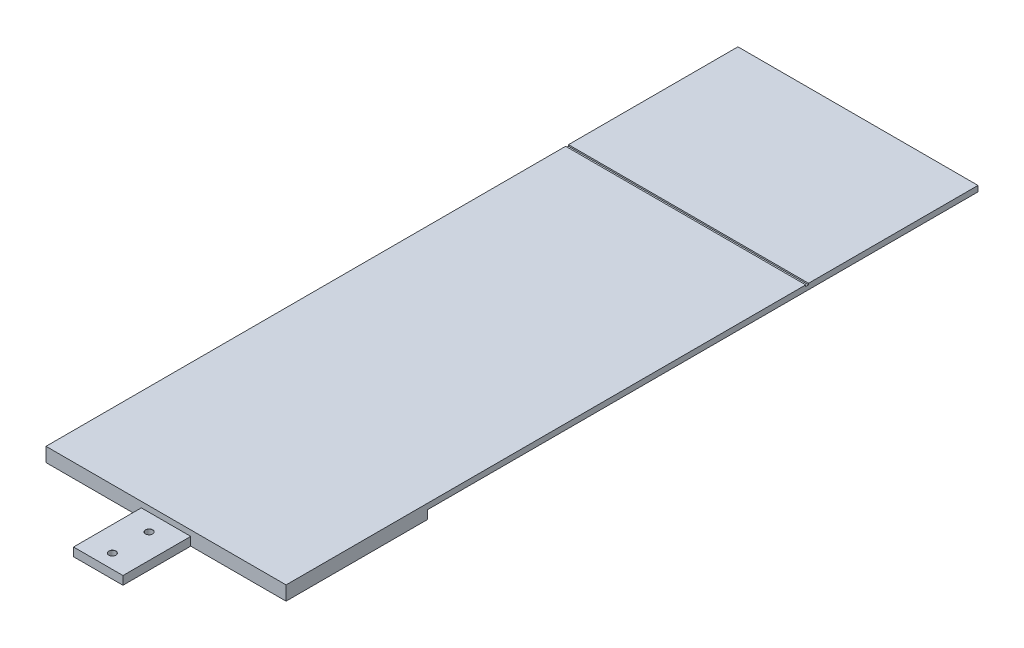
ISO-10303-21;
HEADER;
FILE_DESCRIPTION(('STEP AP214'),'2;1');
FILE_NAME('part.step','',(''),(''),'','','');
FILE_SCHEMA(('AUTOMOTIVE_DESIGN { 1 0 10303 214 1 1 1 1 }'));
ENDSEC;
DATA;
#1=APPLICATION_CONTEXT('core data for automotive mechanical design processes');
#2=APPLICATION_PROTOCOL_DEFINITION('international standard','automotive_design',2000,#1);
#3=PRODUCT_CONTEXT('',#1,'mechanical');
#4=PRODUCT('Part','Part','',(#3));
#5=PRODUCT_RELATED_PRODUCT_CATEGORY('part','',(#4));
#6=PRODUCT_DEFINITION_FORMATION('','',#4);
#7=PRODUCT_DEFINITION_CONTEXT('part definition',#1,'design');
#8=PRODUCT_DEFINITION('design','',#6,#7);
#9=PRODUCT_DEFINITION_SHAPE('','',#8);
#10=(LENGTH_UNIT() NAMED_UNIT(*) SI_UNIT(.MILLI.,.METRE.));
#11=(NAMED_UNIT(*) PLANE_ANGLE_UNIT() SI_UNIT($,.RADIAN.));
#12=(NAMED_UNIT(*) SI_UNIT($,.STERADIAN.) SOLID_ANGLE_UNIT());
#13=UNCERTAINTY_MEASURE_WITH_UNIT(LENGTH_MEASURE(1.E-05),#10,'distance_accuracy_value','');
#14=(GEOMETRIC_REPRESENTATION_CONTEXT(3) GLOBAL_UNCERTAINTY_ASSIGNED_CONTEXT((#13)) GLOBAL_UNIT_ASSIGNED_CONTEXT((#10,
#11,#12)) REPRESENTATION_CONTEXT('',''));
#15=CARTESIAN_POINT('',(0.,0.,0.));
#16=DIRECTION('',(0.,0.,1.));
#17=DIRECTION('',(1.,0.,0.));
#18=AXIS2_PLACEMENT_3D('',#15,#16,#17);
#19=CARTESIAN_POINT('',(0.,5.,0.));
#20=DIRECTION('',(0.,1.,0.));
#21=DIRECTION('',(0.,0.,1.));
#22=AXIS2_PLACEMENT_3D('',#19,#20,#21);
#23=PLANE('',#22);
#24=DIRECTION('',(-1.,0.,0.));
#25=VECTOR('',#24,1.);
#26=CARTESIAN_POINT('',(42.5000000000001,5.,-185.));
#27=LINE('',#26,#25);
#28=CARTESIAN_POINT('',(42.5000000000001,5.,-185.));
#29=VERTEX_POINT('',#28);
#30=CARTESIAN_POINT('',(-42.5,5.,-185.));
#31=VERTEX_POINT('',#30);
#32=EDGE_CURVE('E190',#29,#31,#27,.T.);
#33=ORIENTED_EDGE('',*,*,#32,.F.);
#34=DIRECTION('',(0.,0.,-1.));
#35=VECTOR('',#34,1.);
#36=CARTESIAN_POINT('',(42.5,5.,0.));
#37=LINE('',#36,#35);
#38=CARTESIAN_POINT('',(42.5,5.,-245.));
#39=VERTEX_POINT('',#38);
#40=EDGE_CURVE('E186',#29,#39,#37,.T.);
#41=ORIENTED_EDGE('',*,*,#40,.T.);
#42=DIRECTION('',(-1.,0.,0.));
#43=VECTOR('',#42,1.);
#44=CARTESIAN_POINT('',(42.5,5.,-245.));
#45=LINE('',#44,#43);
#46=CARTESIAN_POINT('',(-42.5,5.,-245.));
#47=VERTEX_POINT('',#46);
#48=EDGE_CURVE('E201',#39,#47,#45,.T.);
#49=ORIENTED_EDGE('',*,*,#48,.T.);
#50=DIRECTION('',(0.,0.,1.));
#51=VECTOR('',#50,1.);
#52=CARTESIAN_POINT('',(-42.5,5.,0.));
#53=LINE('',#52,#51);
#54=EDGE_CURVE('E204',#47,#31,#53,.T.);
#55=ORIENTED_EDGE('',*,*,#54,.T.);
#56=EDGE_LOOP('',(#33,#41,#49,#55));
#57=FACE_BOUND('',#56,.T.);
#58=ADVANCED_FACE('F38',(#57),#23,.T.);
#59=CARTESIAN_POINT('',(-42.5,3.,0.));
#60=DIRECTION('',(0.,0.,-1.));
#61=DIRECTION('',(-1.,0.,0.));
#62=AXIS2_PLACEMENT_3D('',#59,#60,#61);
#63=PLANE('',#62);
#64=DIRECTION('',(1.,0.,0.));
#65=VECTOR('',#64,1.);
#66=CARTESIAN_POINT('',(-42.5,0.,0.));
#67=LINE('',#66,#65);
#68=CARTESIAN_POINT('',(-42.5,0.,0.));
#69=VERTEX_POINT('',#68);
#70=CARTESIAN_POINT('',(-8.75,0.,0.));
#71=VERTEX_POINT('',#70);
#72=EDGE_CURVE('E296',#69,#71,#67,.T.);
#73=ORIENTED_EDGE('',*,*,#72,.T.);
#74=DIRECTION('',(0.,1.,0.));
#75=VECTOR('',#74,1.);
#76=CARTESIAN_POINT('',(-8.75,-29.7026934805583,0.));
#77=LINE('',#76,#75);
#78=CARTESIAN_POINT('',(-8.75,3.,0.));
#79=VERTEX_POINT('',#78);
#80=EDGE_CURVE('E274',#71,#79,#77,.T.);
#81=ORIENTED_EDGE('',*,*,#80,.T.);
#82=DIRECTION('',(1.,0.,0.));
#83=VECTOR('',#82,1.);
#84=CARTESIAN_POINT('',(42.5,3.,0.));
#85=LINE('',#84,#83);
#86=CARTESIAN_POINT('',(8.75,3.,0.));
#87=VERTEX_POINT('',#86);
#88=EDGE_CURVE('E46',#79,#87,#85,.T.);
#89=ORIENTED_EDGE('',*,*,#88,.T.);
#90=DIRECTION('',(0.,1.,0.));
#91=VECTOR('',#90,1.);
#92=CARTESIAN_POINT('',(8.75,-29.7026934805583,0.));
#93=LINE('',#92,#91);
#94=CARTESIAN_POINT('',(8.75,0.,0.));
#95=VERTEX_POINT('',#94);
#96=EDGE_CURVE('E262',#95,#87,#93,.T.);
#97=ORIENTED_EDGE('',*,*,#96,.F.);
#98=CARTESIAN_POINT('',(42.5,0.,0.));
#99=VERTEX_POINT('',#98);
#100=EDGE_CURVE('E284',#95,#99,#67,.T.);
#101=ORIENTED_EDGE('',*,*,#100,.T.);
#102=DIRECTION('',(0.,-1.,0.));
#103=VECTOR('',#102,1.);
#104=CARTESIAN_POINT('',(42.5,3.,0.));
#105=LINE('',#104,#103);
#106=CARTESIAN_POINT('',(42.5,5.,0.));
#107=VERTEX_POINT('',#106);
#108=EDGE_CURVE('E219',#107,#99,#105,.T.);
#109=ORIENTED_EDGE('',*,*,#108,.F.);
#110=DIRECTION('',(1.,0.,0.));
#111=VECTOR('',#110,1.);
#112=CARTESIAN_POINT('',(42.5,5.,0.));
#113=LINE('',#112,#111);
#114=CARTESIAN_POINT('',(-42.5,5.,0.));
#115=VERTEX_POINT('',#114);
#116=EDGE_CURVE('E207',#115,#107,#113,.T.);
#117=ORIENTED_EDGE('',*,*,#116,.F.);
#118=DIRECTION('',(0.,-1.,0.));
#119=VECTOR('',#118,1.);
#120=CARTESIAN_POINT('',(-42.5,3.,0.));
#121=LINE('',#120,#119);
#122=EDGE_CURVE('E295',#115,#69,#121,.T.);
#123=ORIENTED_EDGE('',*,*,#122,.T.);
#124=EDGE_LOOP('',(#73,#81,#89,#97,#101,#109,#117,#123));
#125=FACE_BOUND('',#124,.T.);
#126=ADVANCED_FACE('F40',(#125),#63,.F.);
#127=CARTESIAN_POINT('',(42.5,3.,0.));
#128=DIRECTION('',(-1.,0.,0.));
#129=DIRECTION('',(0.,0.,1.));
#130=AXIS2_PLACEMENT_3D('',#127,#128,#129);
#131=PLANE('',#130);
#132=ORIENTED_EDGE('',*,*,#40,.F.);
#133=DIRECTION('',(0.,-1.,0.));
#134=VECTOR('',#133,1.);
#135=CARTESIAN_POINT('',(42.5000000000001,5.,-185.));
#136=LINE('',#135,#134);
#137=CARTESIAN_POINT('',(42.5000000000001,4.5,-185.));
#138=VERTEX_POINT('',#137);
#139=EDGE_CURVE('E168',#29,#138,#136,.T.);
#140=ORIENTED_EDGE('',*,*,#139,.T.);
#141=DIRECTION('',(0.,0.,1.));
#142=VECTOR('',#141,1.);
#143=CARTESIAN_POINT('',(42.5000000000001,4.5,-185.));
#144=LINE('',#143,#142);
#145=CARTESIAN_POINT('',(42.5000000000001,4.5,-184.));
#146=VERTEX_POINT('',#145);
#147=EDGE_CURVE('E177',#138,#146,#144,.T.);
#148=ORIENTED_EDGE('',*,*,#147,.T.);
#149=DIRECTION('',(0.,1.,0.));
#150=VECTOR('',#149,1.);
#151=CARTESIAN_POINT('',(42.5000000000001,5.,-184.));
#152=LINE('',#151,#150);
#153=CARTESIAN_POINT('',(42.5000000000001,5.,-184.));
#154=VERTEX_POINT('',#153);
#155=EDGE_CURVE('E174',#146,#154,#152,.T.);
#156=ORIENTED_EDGE('',*,*,#155,.T.);
#157=EDGE_CURVE('E198',#107,#154,#37,.T.);
#158=ORIENTED_EDGE('',*,*,#157,.F.);
#159=ORIENTED_EDGE('',*,*,#108,.T.);
#160=DIRECTION('',(0.,0.,-1.));
#161=VECTOR('',#160,1.);
#162=CARTESIAN_POINT('',(42.5,0.,0.));
#163=LINE('',#162,#161);
#164=CARTESIAN_POINT('',(42.5,0.,-50.));
#165=VERTEX_POINT('',#164);
#166=EDGE_CURVE('E298',#99,#165,#163,.T.);
#167=ORIENTED_EDGE('',*,*,#166,.T.);
#168=DIRECTION('',(0.,-1.,0.));
#169=VECTOR('',#168,1.);
#170=CARTESIAN_POINT('',(42.5,3.,-50.));
#171=LINE('',#170,#169);
#172=CARTESIAN_POINT('',(42.5,3.,-50.));
#173=VERTEX_POINT('',#172);
#174=EDGE_CURVE('E313',#173,#165,#171,.T.);
#175=ORIENTED_EDGE('',*,*,#174,.F.);
#176=DIRECTION('',(0.,0.,-1.));
#177=VECTOR('',#176,1.);
#178=CARTESIAN_POINT('',(42.5,3.,0.));
#179=LINE('',#178,#177);
#180=CARTESIAN_POINT('',(42.5,3.,-245.));
#181=VERTEX_POINT('',#180);
#182=EDGE_CURVE('E197',#173,#181,#179,.T.);
#183=ORIENTED_EDGE('',*,*,#182,.T.);
#184=DIRECTION('',(0.,-1.,0.));
#185=VECTOR('',#184,1.);
#186=CARTESIAN_POINT('',(42.5,5.,-245.));
#187=LINE('',#186,#185);
#188=EDGE_CURVE('E222',#39,#181,#187,.T.);
#189=ORIENTED_EDGE('',*,*,#188,.F.);
#190=EDGE_LOOP('',(#132,#140,#148,#156,#158,#159,#167,#175,#183,#189));
#191=FACE_BOUND('',#190,.T.);
#192=ADVANCED_FACE('F184',(#191),#131,.F.);
#193=CARTESIAN_POINT('',(42.5,3.,-50.));
#194=DIRECTION('',(0.,0.,1.));
#195=DIRECTION('',(1.,0.,0.));
#196=AXIS2_PLACEMENT_3D('',#193,#194,#195);
#197=PLANE('',#196);
#198=DIRECTION('',(-1.,0.,0.));
#199=VECTOR('',#198,1.);
#200=CARTESIAN_POINT('',(42.5,0.,-50.));
#201=LINE('',#200,#199);
#202=CARTESIAN_POINT('',(32.,0.,-50.));
#203=VERTEX_POINT('',#202);
#204=EDGE_CURVE('E300',#165,#203,#201,.T.);
#205=ORIENTED_EDGE('',*,*,#204,.T.);
#206=DIRECTION('',(0.,-1.,0.));
#207=VECTOR('',#206,1.);
#208=CARTESIAN_POINT('',(32.,3.,-50.));
#209=LINE('',#208,#207);
#210=CARTESIAN_POINT('',(32.,3.,-50.));
#211=VERTEX_POINT('',#210);
#212=EDGE_CURVE('E61',#211,#203,#209,.T.);
#213=ORIENTED_EDGE('',*,*,#212,.F.);
#214=DIRECTION('',(-1.,0.,0.));
#215=VECTOR('',#214,1.);
#216=CARTESIAN_POINT('',(42.5,3.,-50.));
#217=LINE('',#216,#215);
#218=EDGE_CURVE('E285',#173,#211,#217,.T.);
#219=ORIENTED_EDGE('',*,*,#218,.F.);
#220=ORIENTED_EDGE('',*,*,#174,.T.);
#221=EDGE_LOOP('',(#205,#213,#219,#220));
#222=FACE_BOUND('',#221,.T.);
#223=ADVANCED_FACE('F410',(#222),#197,.F.);
#224=CARTESIAN_POINT('',(8.75,3.,-26.1843013959278));
#225=DIRECTION('',(0.,0.,1.));
#226=DIRECTION('',(1.,0.,0.));
#227=AXIS2_PLACEMENT_3D('',#224,#225,#226);
#228=PLANE('',#227);
#229=DIRECTION('',(-1.,0.,0.));
#230=VECTOR('',#229,1.);
#231=CARTESIAN_POINT('',(8.75,0.,-26.1843013959278));
#232=LINE('',#231,#230);
#233=CARTESIAN_POINT('',(25.,0.,-26.1843013959278));
#234=VERTEX_POINT('',#233);
#235=CARTESIAN_POINT('',(-25.,0.,-26.1843013959278));
#236=VERTEX_POINT('',#235);
#237=EDGE_CURVE('E303',#234,#236,#232,.T.);
#238=ORIENTED_EDGE('',*,*,#237,.T.);
#239=DIRECTION('',(0.,-1.,0.));
#240=VECTOR('',#239,1.);
#241=CARTESIAN_POINT('',(-25.,3.,-26.1843013959278));
#242=LINE('',#241,#240);
#243=CARTESIAN_POINT('',(-25.,3.,-26.1843013959278));
#244=VERTEX_POINT('',#243);
#245=EDGE_CURVE('E239',#244,#236,#242,.T.);
#246=ORIENTED_EDGE('',*,*,#245,.F.);
#247=DIRECTION('',(-1.,0.,0.));
#248=VECTOR('',#247,1.);
#249=CARTESIAN_POINT('',(8.75,3.,-26.1843013959278));
#250=LINE('',#249,#248);
#251=CARTESIAN_POINT('',(25.,3.,-26.1843013959278));
#252=VERTEX_POINT('',#251);
#253=EDGE_CURVE('E288',#252,#244,#250,.T.);
#254=ORIENTED_EDGE('',*,*,#253,.F.);
#255=DIRECTION('',(0.,-1.,0.));
#256=VECTOR('',#255,1.);
#257=CARTESIAN_POINT('',(25.,3.,-26.1843013959278));
#258=LINE('',#257,#256);
#259=EDGE_CURVE('E242',#252,#234,#258,.T.);
#260=ORIENTED_EDGE('',*,*,#259,.T.);
#261=EDGE_LOOP('',(#238,#246,#254,#260));
#262=FACE_BOUND('',#261,.T.);
#263=ADVANCED_FACE('F492',(#262),#228,.F.);
#264=CARTESIAN_POINT('',(-22.5,3.,-50.));
#265=DIRECTION('',(0.,0.,1.));
#266=DIRECTION('',(1.,0.,0.));
#267=AXIS2_PLACEMENT_3D('',#264,#265,#266);
#268=PLANE('',#267);
#269=DIRECTION('',(-1.,0.,0.));
#270=VECTOR('',#269,1.);
#271=CARTESIAN_POINT('',(-22.5,3.,-50.));
#272=LINE('',#271,#270);
#273=CARTESIAN_POINT('',(-32.,3.,-50.));
#274=VERTEX_POINT('',#273);
#275=CARTESIAN_POINT('',(-42.5,3.,-50.));
#276=VERTEX_POINT('',#275);
#277=EDGE_CURVE('E292',#274,#276,#272,.T.);
#278=ORIENTED_EDGE('',*,*,#277,.F.);
#279=DIRECTION('',(0.,-1.,0.));
#280=VECTOR('',#279,1.);
#281=CARTESIAN_POINT('',(-32.,3.,-50.));
#282=LINE('',#281,#280);
#283=CARTESIAN_POINT('',(-32.,0.,-50.));
#284=VERTEX_POINT('',#283);
#285=EDGE_CURVE('E235',#274,#284,#282,.T.);
#286=ORIENTED_EDGE('',*,*,#285,.T.);
#287=DIRECTION('',(-1.,0.,0.));
#288=VECTOR('',#287,1.);
#289=CARTESIAN_POINT('',(-22.5,0.,-50.));
#290=LINE('',#289,#288);
#291=CARTESIAN_POINT('',(-42.5,0.,-50.));
#292=VERTEX_POINT('',#291);
#293=EDGE_CURVE('E305',#284,#292,#290,.T.);
#294=ORIENTED_EDGE('',*,*,#293,.T.);
#295=DIRECTION('',(0.,-1.,0.));
#296=VECTOR('',#295,1.);
#297=CARTESIAN_POINT('',(-42.5,3.,-50.));
#298=LINE('',#297,#296);
#299=EDGE_CURVE('E310',#276,#292,#298,.T.);
#300=ORIENTED_EDGE('',*,*,#299,.F.);
#301=EDGE_LOOP('',(#278,#286,#294,#300));
#302=FACE_BOUND('',#301,.T.);
#303=ADVANCED_FACE('F398',(#302),#268,.F.);
#304=CARTESIAN_POINT('',(-42.5,3.,-50.));
#305=DIRECTION('',(1.,0.,0.));
#306=DIRECTION('',(0.,0.,-1.));
#307=AXIS2_PLACEMENT_3D('',#304,#305,#306);
#308=PLANE('',#307);
#309=DIRECTION('',(0.,0.,-1.));
#310=VECTOR('',#309,1.);
#311=CARTESIAN_POINT('',(-42.5,4.5,-50.));
#312=LINE('',#311,#310);
#313=CARTESIAN_POINT('',(-42.5,4.5,-184.));
#314=VERTEX_POINT('',#313);
#315=CARTESIAN_POINT('',(-42.5,4.5,-185.));
#316=VERTEX_POINT('',#315);
#317=EDGE_CURVE('E11',#314,#316,#312,.T.);
#318=ORIENTED_EDGE('',*,*,#317,.T.);
#319=DIRECTION('',(0.,1.,0.));
#320=VECTOR('',#319,1.);
#321=CARTESIAN_POINT('',(-42.5,3.,-185.));
#322=LINE('',#321,#320);
#323=EDGE_CURVE('E171',#316,#31,#322,.T.);
#324=ORIENTED_EDGE('',*,*,#323,.T.);
#325=ORIENTED_EDGE('',*,*,#54,.F.);
#326=DIRECTION('',(0.,-1.,0.));
#327=VECTOR('',#326,1.);
#328=CARTESIAN_POINT('',(-42.5,5.,-245.));
#329=LINE('',#328,#327);
#330=CARTESIAN_POINT('',(-42.5,3.,-245.));
#331=VERTEX_POINT('',#330);
#332=EDGE_CURVE('E210',#47,#331,#329,.T.);
#333=ORIENTED_EDGE('',*,*,#332,.T.);
#334=DIRECTION('',(0.,0.,1.));
#335=VECTOR('',#334,1.);
#336=CARTESIAN_POINT('',(-42.5,3.,0.));
#337=LINE('',#336,#335);
#338=EDGE_CURVE('E214',#331,#276,#337,.T.);
#339=ORIENTED_EDGE('',*,*,#338,.T.);
#340=ORIENTED_EDGE('',*,*,#299,.T.);
#341=DIRECTION('',(0.,0.,1.));
#342=VECTOR('',#341,1.);
#343=CARTESIAN_POINT('',(-42.5,0.,-50.));
#344=LINE('',#343,#342);
#345=EDGE_CURVE('E289',#292,#69,#344,.T.);
#346=ORIENTED_EDGE('',*,*,#345,.T.);
#347=ORIENTED_EDGE('',*,*,#122,.F.);
#348=CARTESIAN_POINT('',(-42.5,5.,-184.));
#349=VERTEX_POINT('',#348);
#350=EDGE_CURVE('E203',#349,#115,#53,.T.);
#351=ORIENTED_EDGE('',*,*,#350,.F.);
#352=DIRECTION('',(0.,-1.,0.));
#353=VECTOR('',#352,1.);
#354=CARTESIAN_POINT('',(-42.5,3.,-184.));
#355=LINE('',#354,#353);
#356=EDGE_CURVE('E53',#349,#314,#355,.T.);
#357=ORIENTED_EDGE('',*,*,#356,.T.);
#358=EDGE_LOOP('',(#318,#324,#325,#333,#339,#340,#346,#347,#351,#357));
#359=FACE_BOUND('',#358,.T.);
#360=ADVANCED_FACE('F366',(#359),#308,.F.);
#361=CARTESIAN_POINT('',(0.,3.,0.));
#362=DIRECTION('',(0.,1.,0.));
#363=DIRECTION('',(0.,0.,1.));
#364=AXIS2_PLACEMENT_3D('',#361,#362,#363);
#365=PLANE('',#364);
#366=ORIENTED_EDGE('',*,*,#88,.F.);
#367=DIRECTION('',(0.,0.,1.));
#368=VECTOR('',#367,1.);
#369=CARTESIAN_POINT('',(-8.75,3.,0.));
#370=LINE('',#369,#368);
#371=CARTESIAN_POINT('',(-8.75,3.,24.));
#372=VERTEX_POINT('',#371);
#373=EDGE_CURVE('E265',#79,#372,#370,.T.);
#374=ORIENTED_EDGE('',*,*,#373,.T.);
#375=DIRECTION('',(1.,0.,0.));
#376=VECTOR('',#375,1.);
#377=CARTESIAN_POINT('',(-8.75,3.,24.));
#378=LINE('',#377,#376);
#379=CARTESIAN_POINT('',(8.75,3.,24.));
#380=VERTEX_POINT('',#379);
#381=EDGE_CURVE('E268',#372,#380,#378,.T.);
#382=ORIENTED_EDGE('',*,*,#381,.T.);
#383=DIRECTION('',(0.,0.,-1.));
#384=VECTOR('',#383,1.);
#385=CARTESIAN_POINT('',(8.75,3.,24.));
#386=LINE('',#385,#384);
#387=EDGE_CURVE('E271',#380,#87,#386,.T.);
#388=ORIENTED_EDGE('',*,*,#387,.T.);
#389=EDGE_LOOP('',(#366,#374,#382,#388));
#390=FACE_BOUND('',#389,.T.);
#391=CARTESIAN_POINT('',(0.,3.,19.));
#392=DIRECTION('',(0.,1.,0.));
#393=DIRECTION('',(0.,0.,1.));
#394=AXIS2_PLACEMENT_3D('',#391,#392,#393);
#395=CIRCLE('',#394,1.275);
#396=CARTESIAN_POINT('',(0.,3.,20.275));
#397=VERTEX_POINT('',#396);
#398=EDGE_CURVE('E238',#397,#397,#395,.T.);
#399=ORIENTED_EDGE('',*,*,#398,.F.);
#400=EDGE_LOOP('',(#399));
#401=FACE_BOUND('',#400,.T.);
#402=CARTESIAN_POINT('',(0.,3.,6.));
#403=DIRECTION('',(0.,1.,0.));
#404=DIRECTION('',(0.,0.,1.));
#405=AXIS2_PLACEMENT_3D('',#402,#403,#404);
#406=CIRCLE('',#405,1.275);
#407=CARTESIAN_POINT('',(0.,3.,7.275));
#408=VERTEX_POINT('',#407);
#409=EDGE_CURVE('E252',#408,#408,#406,.T.);
#410=ORIENTED_EDGE('',*,*,#409,.F.);
#411=EDGE_LOOP('',(#410));
#412=FACE_BOUND('',#411,.T.);
#413=ADVANCED_FACE('F397',(#390,#401,#412),#365,.T.);
#414=CARTESIAN_POINT('',(0.,0.,0.));
#415=DIRECTION('',(0.,1.,0.));
#416=DIRECTION('',(0.,0.,1.));
#417=AXIS2_PLACEMENT_3D('',#414,#415,#416);
#418=PLANE('',#417);
#419=CARTESIAN_POINT('',(0.,0.,19.));
#420=DIRECTION('',(0.,1.,0.));
#421=DIRECTION('',(0.,0.,1.));
#422=AXIS2_PLACEMENT_3D('',#419,#420,#421);
#423=CIRCLE('',#422,1.25);
#424=CARTESIAN_POINT('',(0.,0.,20.25));
#425=VERTEX_POINT('',#424);
#426=EDGE_CURVE('E251',#425,#425,#423,.T.);
#427=ORIENTED_EDGE('',*,*,#426,.T.);
#428=EDGE_LOOP('',(#427));
#429=FACE_BOUND('',#428,.T.);
#430=CARTESIAN_POINT('',(0.,0.,6.));
#431=DIRECTION('',(0.,1.,0.));
#432=DIRECTION('',(0.,0.,1.));
#433=AXIS2_PLACEMENT_3D('',#430,#431,#432);
#434=CIRCLE('',#433,1.25);
#435=CARTESIAN_POINT('',(0.,0.,7.25));
#436=VERTEX_POINT('',#435);
#437=EDGE_CURVE('E258',#436,#436,#434,.T.);
#438=ORIENTED_EDGE('',*,*,#437,.T.);
#439=EDGE_LOOP('',(#438));
#440=FACE_BOUND('',#439,.T.);
#441=ORIENTED_EDGE('',*,*,#293,.F.);
#442=DIRECTION('',(-0.281995123396906,0.,-0.959415838091265));
#443=VECTOR('',#442,1.);
#444=CARTESIAN_POINT('',(-32.,0.,-50.));
#445=LINE('',#444,#443);
#446=EDGE_CURVE('E230',#236,#284,#445,.T.);
#447=ORIENTED_EDGE('',*,*,#446,.F.);
#448=ORIENTED_EDGE('',*,*,#237,.F.);
#449=DIRECTION('',(-0.281995123396906,0.,0.959415838091265));
#450=VECTOR('',#449,1.);
#451=CARTESIAN_POINT('',(25.,0.,-26.1843013959278));
#452=LINE('',#451,#450);
#453=EDGE_CURVE('E225',#203,#234,#452,.T.);
#454=ORIENTED_EDGE('',*,*,#453,.F.);
#455=ORIENTED_EDGE('',*,*,#204,.F.);
#456=ORIENTED_EDGE('',*,*,#166,.F.);
#457=ORIENTED_EDGE('',*,*,#100,.F.);
#458=DIRECTION('',(0.,0.,1.));
#459=VECTOR('',#458,1.);
#460=CARTESIAN_POINT('',(8.75,0.,24.));
#461=LINE('',#460,#459);
#462=CARTESIAN_POINT('',(8.75,0.,24.));
#463=VERTEX_POINT('',#462);
#464=EDGE_CURVE('E261',#95,#463,#461,.T.);
#465=ORIENTED_EDGE('',*,*,#464,.T.);
#466=DIRECTION('',(-1.,0.,0.));
#467=VECTOR('',#466,1.);
#468=CARTESIAN_POINT('',(-8.75,0.,24.));
#469=LINE('',#468,#467);
#470=CARTESIAN_POINT('',(-8.75,0.,24.));
#471=VERTEX_POINT('',#470);
#472=EDGE_CURVE('E259',#463,#471,#469,.T.);
#473=ORIENTED_EDGE('',*,*,#472,.T.);
#474=DIRECTION('',(0.,0.,-1.));
#475=VECTOR('',#474,1.);
#476=CARTESIAN_POINT('',(-8.75,0.,0.));
#477=LINE('',#476,#475);
#478=EDGE_CURVE('E264',#471,#71,#477,.T.);
#479=ORIENTED_EDGE('',*,*,#478,.T.);
#480=ORIENTED_EDGE('',*,*,#72,.F.);
#481=ORIENTED_EDGE('',*,*,#345,.F.);
#482=EDGE_LOOP('',(#441,#447,#448,#454,#455,#456,#457,#465,#473,#479,#480,#481));
#483=FACE_BOUND('',#482,.T.);
#484=ADVANCED_FACE('F322',(#429,#440,#483),#418,.F.);
#485=CARTESIAN_POINT('',(8.75,-29.7026934805583,24.));
#486=DIRECTION('',(1.,0.,0.));
#487=DIRECTION('',(0.,0.,-1.));
#488=AXIS2_PLACEMENT_3D('',#485,#486,#487);
#489=PLANE('',#488);
#490=ORIENTED_EDGE('',*,*,#464,.F.);
#491=ORIENTED_EDGE('',*,*,#96,.T.);
#492=ORIENTED_EDGE('',*,*,#387,.F.);
#493=DIRECTION('',(0.,1.,0.));
#494=VECTOR('',#493,1.);
#495=CARTESIAN_POINT('',(8.75,-29.7026934805583,24.));
#496=LINE('',#495,#494);
#497=EDGE_CURVE('E276',#463,#380,#496,.T.);
#498=ORIENTED_EDGE('',*,*,#497,.F.);
#499=EDGE_LOOP('',(#490,#491,#492,#498));
#500=FACE_BOUND('',#499,.T.);
#501=ADVANCED_FACE('F467',(#500),#489,.T.);
#502=CARTESIAN_POINT('',(-8.75,-29.7026934805583,24.));
#503=DIRECTION('',(0.,0.,1.));
#504=DIRECTION('',(1.,0.,0.));
#505=AXIS2_PLACEMENT_3D('',#502,#503,#504);
#506=PLANE('',#505);
#507=ORIENTED_EDGE('',*,*,#472,.F.);
#508=ORIENTED_EDGE('',*,*,#497,.T.);
#509=ORIENTED_EDGE('',*,*,#381,.F.);
#510=DIRECTION('',(0.,1.,0.));
#511=VECTOR('',#510,1.);
#512=CARTESIAN_POINT('',(-8.75,-29.7026934805583,24.));
#513=LINE('',#512,#511);
#514=EDGE_CURVE('E278',#471,#372,#513,.T.);
#515=ORIENTED_EDGE('',*,*,#514,.F.);
#516=EDGE_LOOP('',(#507,#508,#509,#515));
#517=FACE_BOUND('',#516,.T.);
#518=ADVANCED_FACE('F457',(#517),#506,.T.);
#519=CARTESIAN_POINT('',(-8.75,-29.7026934805583,0.));
#520=DIRECTION('',(-1.,0.,0.));
#521=DIRECTION('',(0.,0.,1.));
#522=AXIS2_PLACEMENT_3D('',#519,#520,#521);
#523=PLANE('',#522);
#524=ORIENTED_EDGE('',*,*,#478,.F.);
#525=ORIENTED_EDGE('',*,*,#514,.T.);
#526=ORIENTED_EDGE('',*,*,#373,.F.);
#527=ORIENTED_EDGE('',*,*,#80,.F.);
#528=EDGE_LOOP('',(#524,#525,#526,#527));
#529=FACE_BOUND('',#528,.T.);
#530=ADVANCED_FACE('F452',(#529),#523,.T.);
#531=CARTESIAN_POINT('',(0.,3.,6.));
#532=DIRECTION('',(0.,1.,0.));
#533=DIRECTION('',(0.,0.,1.));
#534=AXIS2_PLACEMENT_3D('',#531,#532,#533);
#535=CYLINDRICAL_SURFACE('',#534,1.25);
#536=CARTESIAN_POINT('',(0.,2.975,6.));
#537=DIRECTION('',(0.,1.,0.));
#538=DIRECTION('',(0.,0.,1.));
#539=AXIS2_PLACEMENT_3D('',#536,#537,#538);
#540=CIRCLE('',#539,1.25);
#541=CARTESIAN_POINT('',(0.,2.975,7.25));
#542=VERTEX_POINT('',#541);
#543=EDGE_CURVE('E255',#542,#542,#540,.T.);
#544=ORIENTED_EDGE('',*,*,#543,.T.);
#545=EDGE_LOOP('',(#544));
#546=FACE_BOUND('',#545,.T.);
#547=ORIENTED_EDGE('',*,*,#437,.F.);
#548=EDGE_LOOP('',(#547));
#549=FACE_BOUND('',#548,.T.);
#550=ADVANCED_FACE('F338',(#546,#549),#535,.F.);
#551=CARTESIAN_POINT('',(0.,3.,6.));
#552=DIRECTION('',(0.,1.,0.));
#553=DIRECTION('',(0.,0.,1.));
#554=AXIS2_PLACEMENT_3D('',#551,#552,#553);
#555=CONICAL_SURFACE('',#554,1.275,0.785398163397444);
#556=ORIENTED_EDGE('',*,*,#543,.F.);
#557=EDGE_LOOP('',(#556));
#558=FACE_BOUND('',#557,.T.);
#559=ORIENTED_EDGE('',*,*,#409,.T.);
#560=EDGE_LOOP('',(#559));
#561=FACE_BOUND('',#560,.T.);
#562=ADVANCED_FACE('F328',(#558,#561),#555,.F.);
#563=CARTESIAN_POINT('',(0.,3.,19.));
#564=DIRECTION('',(0.,1.,0.));
#565=DIRECTION('',(0.,0.,1.));
#566=AXIS2_PLACEMENT_3D('',#563,#564,#565);
#567=CYLINDRICAL_SURFACE('',#566,1.25);
#568=CARTESIAN_POINT('',(0.,2.975,19.));
#569=DIRECTION('',(0.,1.,0.));
#570=DIRECTION('',(0.,0.,1.));
#571=AXIS2_PLACEMENT_3D('',#568,#569,#570);
#572=CIRCLE('',#571,1.25);
#573=CARTESIAN_POINT('',(0.,2.975,20.25));
#574=VERTEX_POINT('',#573);
#575=EDGE_CURVE('E248',#574,#574,#572,.T.);
#576=ORIENTED_EDGE('',*,*,#575,.T.);
#577=EDGE_LOOP('',(#576));
#578=FACE_BOUND('',#577,.T.);
#579=ORIENTED_EDGE('',*,*,#426,.F.);
#580=EDGE_LOOP('',(#579));
#581=FACE_BOUND('',#580,.T.);
#582=ADVANCED_FACE('F325',(#578,#581),#567,.F.);
#583=CARTESIAN_POINT('',(0.,3.,19.));
#584=DIRECTION('',(0.,1.,0.));
#585=DIRECTION('',(0.,0.,1.));
#586=AXIS2_PLACEMENT_3D('',#583,#584,#585);
#587=CONICAL_SURFACE('',#586,1.275,0.785398163397444);
#588=ORIENTED_EDGE('',*,*,#575,.F.);
#589=EDGE_LOOP('',(#588));
#590=FACE_BOUND('',#589,.T.);
#591=ORIENTED_EDGE('',*,*,#398,.T.);
#592=EDGE_LOOP('',(#591));
#593=FACE_BOUND('',#592,.T.);
#594=ADVANCED_FACE('F327',(#590,#593),#587,.F.);
#595=CARTESIAN_POINT('',(25.,3.,-26.1843013959278));
#596=DIRECTION('',(0.959415838091265,0.,0.281995123396906));
#597=DIRECTION('',(0.281995123396906,0.,-0.959415838091265));
#598=AXIS2_PLACEMENT_3D('',#595,#596,#597);
#599=PLANE('',#598);
#600=ORIENTED_EDGE('',*,*,#453,.T.);
#601=ORIENTED_EDGE('',*,*,#259,.F.);
#602=DIRECTION('',(-0.281995123396906,0.,0.959415838091265));
#603=VECTOR('',#602,1.);
#604=CARTESIAN_POINT('',(25.,3.,-26.1843013959278));
#605=LINE('',#604,#603);
#606=EDGE_CURVE('E226',#211,#252,#605,.T.);
#607=ORIENTED_EDGE('',*,*,#606,.F.);
#608=ORIENTED_EDGE('',*,*,#212,.T.);
#609=EDGE_LOOP('',(#600,#601,#607,#608));
#610=FACE_BOUND('',#609,.T.);
#611=ADVANCED_FACE('F335',(#610),#599,.F.);
#612=CARTESIAN_POINT('',(-32.,3.,-50.));
#613=DIRECTION('',(-0.959415838091265,0.,0.281995123396906));
#614=DIRECTION('',(0.281995123396906,0.,0.959415838091265));
#615=AXIS2_PLACEMENT_3D('',#612,#613,#614);
#616=PLANE('',#615);
#617=ORIENTED_EDGE('',*,*,#446,.T.);
#618=ORIENTED_EDGE('',*,*,#285,.F.);
#619=DIRECTION('',(-0.281995123396906,0.,-0.959415838091265));
#620=VECTOR('',#619,1.);
#621=CARTESIAN_POINT('',(-32.,3.,-50.));
#622=LINE('',#621,#620);
#623=EDGE_CURVE('E229',#244,#274,#622,.T.);
#624=ORIENTED_EDGE('',*,*,#623,.F.);
#625=ORIENTED_EDGE('',*,*,#245,.T.);
#626=EDGE_LOOP('',(#617,#618,#624,#625));
#627=FACE_BOUND('',#626,.T.);
#628=ADVANCED_FACE('F429',(#627),#616,.F.);
#629=CARTESIAN_POINT('',(0.,3.,0.));
#630=DIRECTION('',(0.,1.,0.));
#631=DIRECTION('',(0.,0.,1.));
#632=AXIS2_PLACEMENT_3D('',#629,#630,#631);
#633=PLANE('',#632);
#634=ORIENTED_EDGE('',*,*,#623,.T.);
#635=ORIENTED_EDGE('',*,*,#277,.T.);
#636=ORIENTED_EDGE('',*,*,#338,.F.);
#637=DIRECTION('',(-1.,0.,0.));
#638=VECTOR('',#637,1.);
#639=CARTESIAN_POINT('',(42.5,3.,-245.));
#640=LINE('',#639,#638);
#641=EDGE_CURVE('E212',#181,#331,#640,.T.);
#642=ORIENTED_EDGE('',*,*,#641,.F.);
#643=ORIENTED_EDGE('',*,*,#182,.F.);
#644=ORIENTED_EDGE('',*,*,#218,.T.);
#645=ORIENTED_EDGE('',*,*,#606,.T.);
#646=ORIENTED_EDGE('',*,*,#253,.T.);
#647=EDGE_LOOP('',(#634,#635,#636,#642,#643,#644,#645,#646));
#648=FACE_BOUND('',#647,.T.);
#649=ADVANCED_FACE('F359',(#648),#633,.F.);
#650=CARTESIAN_POINT('',(42.5,5.,-245.));
#651=DIRECTION('',(0.,0.,1.));
#652=DIRECTION('',(1.,0.,0.));
#653=AXIS2_PLACEMENT_3D('',#650,#651,#652);
#654=PLANE('',#653);
#655=ORIENTED_EDGE('',*,*,#641,.T.);
#656=ORIENTED_EDGE('',*,*,#332,.F.);
#657=ORIENTED_EDGE('',*,*,#48,.F.);
#658=ORIENTED_EDGE('',*,*,#188,.T.);
#659=EDGE_LOOP('',(#655,#656,#657,#658));
#660=FACE_BOUND('',#659,.T.);
#661=ADVANCED_FACE('F352',(#660),#654,.F.);
#662=DIRECTION('',(-1.,0.,0.));
#663=VECTOR('',#662,1.);
#664=CARTESIAN_POINT('',(42.5000000000001,5.,-184.));
#665=LINE('',#664,#663);
#666=EDGE_CURVE('E192',#154,#349,#665,.T.);
#667=ORIENTED_EDGE('',*,*,#666,.T.);
#668=ORIENTED_EDGE('',*,*,#350,.T.);
#669=ORIENTED_EDGE('',*,*,#116,.T.);
#670=ORIENTED_EDGE('',*,*,#157,.T.);
#671=EDGE_LOOP('',(#667,#668,#669,#670));
#672=FACE_BOUND('',#671,.T.);
#673=ADVANCED_FACE('F344',(#672),#23,.T.);
#674=CARTESIAN_POINT('',(42.5000000000001,4.5,-185.));
#675=DIRECTION('',(0.,-1.,0.));
#676=DIRECTION('',(0.,0.,-1.));
#677=AXIS2_PLACEMENT_3D('',#674,#675,#676);
#678=PLANE('',#677);
#679=DIRECTION('',(-1.,0.,0.));
#680=VECTOR('',#679,1.);
#681=CARTESIAN_POINT('',(42.5000000000001,4.5,-184.));
#682=LINE('',#681,#680);
#683=EDGE_CURVE('E173',#146,#314,#682,.T.);
#684=ORIENTED_EDGE('',*,*,#683,.F.);
#685=ORIENTED_EDGE('',*,*,#147,.F.);
#686=DIRECTION('',(-1.,0.,0.));
#687=VECTOR('',#686,1.);
#688=CARTESIAN_POINT('',(42.5000000000001,4.5,-185.));
#689=LINE('',#688,#687);
#690=EDGE_CURVE('E164',#138,#316,#689,.T.);
#691=ORIENTED_EDGE('',*,*,#690,.T.);
#692=ORIENTED_EDGE('',*,*,#317,.F.);
#693=EDGE_LOOP('',(#684,#685,#691,#692));
#694=FACE_BOUND('',#693,.T.);
#695=ADVANCED_FACE('F178',(#694),#678,.F.);
#696=CARTESIAN_POINT('',(42.5000000000001,5.,-185.));
#697=DIRECTION('',(0.,0.,-1.));
#698=DIRECTION('',(-1.,0.,0.));
#699=AXIS2_PLACEMENT_3D('',#696,#697,#698);
#700=PLANE('',#699);
#701=ORIENTED_EDGE('',*,*,#690,.F.);
#702=ORIENTED_EDGE('',*,*,#139,.F.);
#703=ORIENTED_EDGE('',*,*,#32,.T.);
#704=ORIENTED_EDGE('',*,*,#323,.F.);
#705=EDGE_LOOP('',(#701,#702,#703,#704));
#706=FACE_BOUND('',#705,.T.);
#707=ADVANCED_FACE('F166',(#706),#700,.F.);
#708=CARTESIAN_POINT('',(42.5000000000001,5.,-184.));
#709=DIRECTION('',(0.,0.,1.));
#710=DIRECTION('',(1.,0.,0.));
#711=AXIS2_PLACEMENT_3D('',#708,#709,#710);
#712=PLANE('',#711);
#713=ORIENTED_EDGE('',*,*,#666,.F.);
#714=ORIENTED_EDGE('',*,*,#155,.F.);
#715=ORIENTED_EDGE('',*,*,#683,.T.);
#716=ORIENTED_EDGE('',*,*,#356,.F.);
#717=EDGE_LOOP('',(#713,#714,#715,#716));
#718=FACE_BOUND('',#717,.T.);
#719=ADVANCED_FACE('F370',(#718),#712,.F.);
#720=CLOSED_SHELL('',(#58,#126,#192,#223,#263,#303,#360,#413,#484,#501,#518,#530,#550,#562,#582,
#594,#611,#628,#649,#661,#673,#695,#707,#719));
#721=MANIFOLD_SOLID_BREP('B2',#720);
#722=ADVANCED_BREP_SHAPE_REPRESENTATION('',(#18,#721),#14);
#723=SHAPE_DEFINITION_REPRESENTATION(#9,#722);
ENDSEC;
END-ISO-10303-21;
